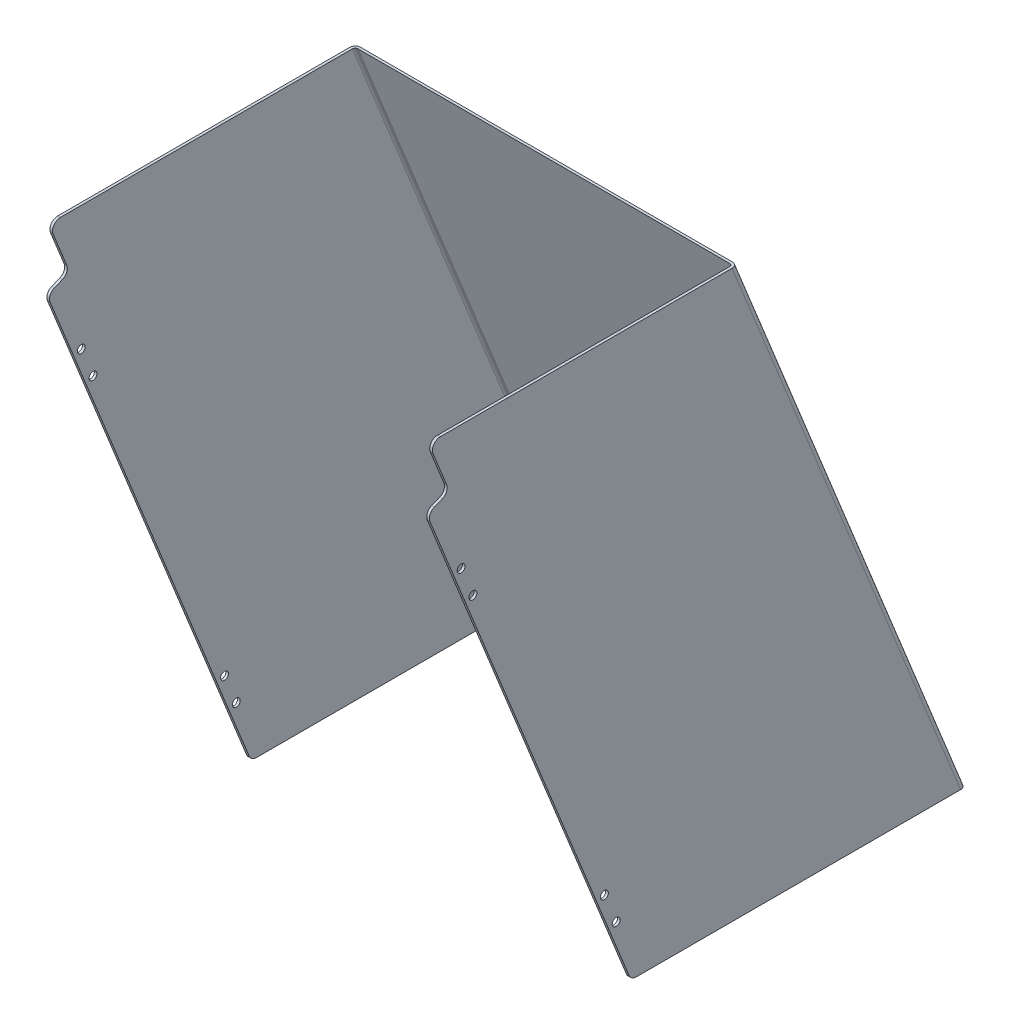
ISO-10303-21;
HEADER;
FILE_DESCRIPTION(('STEP AP214'),'2;1');
FILE_NAME('part.step','',(''),(''),'','','');
FILE_SCHEMA(('AUTOMOTIVE_DESIGN { 1 0 10303 214 1 1 1 1 }'));
ENDSEC;
DATA;
#1=APPLICATION_CONTEXT('core data for automotive mechanical design processes');
#2=APPLICATION_PROTOCOL_DEFINITION('international standard','automotive_design',2000,#1);
#3=PRODUCT_CONTEXT('',#1,'mechanical');
#4=PRODUCT('Part','Part','',(#3));
#5=PRODUCT_RELATED_PRODUCT_CATEGORY('part','',(#4));
#6=PRODUCT_DEFINITION_FORMATION('','',#4);
#7=PRODUCT_DEFINITION_CONTEXT('part definition',#1,'design');
#8=PRODUCT_DEFINITION('design','',#6,#7);
#9=PRODUCT_DEFINITION_SHAPE('','',#8);
#10=(LENGTH_UNIT() NAMED_UNIT(*) SI_UNIT(.MILLI.,.METRE.));
#11=(NAMED_UNIT(*) PLANE_ANGLE_UNIT() SI_UNIT($,.RADIAN.));
#12=(NAMED_UNIT(*) SI_UNIT($,.STERADIAN.) SOLID_ANGLE_UNIT());
#13=UNCERTAINTY_MEASURE_WITH_UNIT(LENGTH_MEASURE(1.E-05),#10,'distance_accuracy_value','');
#14=(GEOMETRIC_REPRESENTATION_CONTEXT(3) GLOBAL_UNCERTAINTY_ASSIGNED_CONTEXT((#13)) GLOBAL_UNIT_ASSIGNED_CONTEXT((#10,
#11,#12)) REPRESENTATION_CONTEXT('',''));
#15=CARTESIAN_POINT('',(0.,0.,0.));
#16=DIRECTION('',(0.,0.,1.));
#17=DIRECTION('',(1.,0.,0.));
#18=AXIS2_PLACEMENT_3D('',#15,#16,#17);
#19=CARTESIAN_POINT('',(231.775,-62.8672060767664,-57.15));
#20=DIRECTION('',(0.,0.374606593415897,-0.927183854566793));
#21=DIRECTION('',(0.,0.927183854566793,0.374606593415897));
#22=AXIS2_PLACEMENT_3D('',#19,#20,#21);
#23=PLANE('',#22);
#24=DIRECTION('',(-1.,0.,0.));
#25=VECTOR('',#24,1.);
#26=CARTESIAN_POINT('',(836.05878,-54.0357798620357,-53.5818721977024));
#27=LINE('',#26,#25);
#28=CARTESIAN_POINT('',(-231.775,-54.0357798620329,-53.5818721977072));
#29=VERTEX_POINT('',#28);
#30=CARTESIAN_POINT('',(-228.6,-54.0357798620329,-53.5818721977072));
#31=VERTEX_POINT('',#30);
#32=EDGE_CURVE('E218',#29,#31,#27,.F.);
#33=ORIENTED_EDGE('',*,*,#32,.T.);
#34=DIRECTION('',(0.,-0.927183854566865,-0.37460659341572));
#35=VECTOR('',#34,1.);
#36=CARTESIAN_POINT('',(-228.6,-13.0931278022874,-37.039967010342));
#37=LINE('',#36,#35);
#38=CARTESIAN_POINT('',(-228.6,-13.0931278022861,-37.0399670103347));
#39=VERTEX_POINT('',#38);
#40=EDGE_CURVE('E323',#39,#31,#37,.T.);
#41=ORIENTED_EDGE('',*,*,#40,.F.);
#42=DIRECTION('',(1.,0.,0.));
#43=VECTOR('',#42,1.);
#44=CARTESIAN_POINT('',(-836.05878,-13.0931278022921,-37.0399670103304));
#45=LINE('',#44,#43);
#46=CARTESIAN_POINT('',(-231.775,-13.0931278022861,-37.0399670103347));
#47=VERTEX_POINT('',#46);
#48=EDGE_CURVE('E172',#47,#39,#45,.T.);
#49=ORIENTED_EDGE('',*,*,#48,.F.);
#50=DIRECTION('',(0.,-0.927183854566865,-0.37460659341572));
#51=VECTOR('',#50,1.);
#52=CARTESIAN_POINT('',(-231.775,-13.0931278022874,-37.039967010342));
#53=LINE('',#52,#51);
#54=EDGE_CURVE('E296',#47,#29,#53,.T.);
#55=ORIENTED_EDGE('',*,*,#54,.T.);
#56=EDGE_LOOP('',(#33,#41,#49,#55));
#57=FACE_BOUND('',#56,.T.);
#58=ADVANCED_FACE('F16',(#57),#23,.F.);
#59=CARTESIAN_POINT('',(836.05878,-57.603907664319,-44.7504459829524));
#60=DIRECTION('',(-1.,0.,0.));
#61=DIRECTION('',(0.,0.,1.));
#62=AXIS2_PLACEMENT_3D('',#59,#60,#61);
#63=CYLINDRICAL_SURFACE('',#62,9.525);
#64=DIRECTION('',(1.,0.,0.));
#65=VECTOR('',#64,1.);
#66=CARTESIAN_POINT('',(231.775,-66.4353338790571,-48.3185737852411));
#67=LINE('',#66,#65);
#68=CARTESIAN_POINT('',(-231.775,-66.4353338790554,-48.3185737852406));
#69=VERTEX_POINT('',#68);
#70=CARTESIAN_POINT('',(-228.6,-66.4353338790554,-48.3185737852406));
#71=VERTEX_POINT('',#70);
#72=EDGE_CURVE('E215',#69,#71,#67,.T.);
#73=ORIENTED_EDGE('',*,*,#72,.T.);
#74=CARTESIAN_POINT('',(-228.6,-57.603907664319,-44.7504459829524));
#75=DIRECTION('',(-1.,0.,0.));
#76=DIRECTION('',(0.,0.,1.));
#77=AXIS2_PLACEMENT_3D('',#74,#75,#76);
#78=CIRCLE('',#77,9.525);
#79=EDGE_CURVE('E321',#31,#71,#78,.T.);
#80=ORIENTED_EDGE('',*,*,#79,.F.);
#81=ORIENTED_EDGE('',*,*,#32,.F.);
#82=CARTESIAN_POINT('',(-231.775,-57.603907664319,-44.7504459829524));
#83=DIRECTION('',(-1.,0.,0.));
#84=DIRECTION('',(0.,0.,1.));
#85=AXIS2_PLACEMENT_3D('',#82,#83,#84);
#86=CIRCLE('',#85,9.525);
#87=EDGE_CURVE('E293',#29,#69,#86,.T.);
#88=ORIENTED_EDGE('',*,*,#87,.T.);
#89=EDGE_LOOP('',(#73,#80,#81,#88));
#90=FACE_BOUND('',#89,.T.);
#91=ADVANCED_FACE('F456',(#90),#63,.F.);
#92=CARTESIAN_POINT('',(231.775,-73.8949077078062,-29.8554806696152));
#93=DIRECTION('',(0.,-0.927183854566793,-0.374606593415897));
#94=DIRECTION('',(0.,0.374606593415897,-0.927183854566793));
#95=AXIS2_PLACEMENT_3D('',#92,#93,#94);
#96=PLANE('',#95);
#97=ORIENTED_EDGE('',*,*,#72,.F.);
#98=DIRECTION('',(0.,-0.37460659341652,0.927183854566542));
#99=VECTOR('',#98,1.);
#100=CARTESIAN_POINT('',(-231.775,-66.4353338790538,-48.3185737852398));
#101=LINE('',#100,#99);
#102=CARTESIAN_POINT('',(-231.775,-70.3267799055257,-38.6869068843729));
#103=VERTEX_POINT('',#102);
#104=EDGE_CURVE('E292',#69,#103,#101,.T.);
#105=ORIENTED_EDGE('',*,*,#104,.T.);
#106=DIRECTION('',(-1.,0.,0.));
#107=VECTOR('',#106,1.);
#108=CARTESIAN_POINT('',(836.05878,-70.326779905529,-38.6869068843795));
#109=LINE('',#108,#107);
#110=CARTESIAN_POINT('',(-228.6,-70.3267799055257,-38.6869068843729));
#111=VERTEX_POINT('',#110);
#112=EDGE_CURVE('E213',#111,#103,#109,.T.);
#113=ORIENTED_EDGE('',*,*,#112,.F.);
#114=DIRECTION('',(0.,-0.37460659341652,0.927183854566542));
#115=VECTOR('',#114,1.);
#116=CARTESIAN_POINT('',(-228.6,-66.4353338790538,-48.3185737852398));
#117=LINE('',#116,#115);
#118=EDGE_CURVE('E320',#71,#111,#117,.T.);
#119=ORIENTED_EDGE('',*,*,#118,.F.);
#120=EDGE_LOOP('',(#97,#105,#113,#119));
#121=FACE_BOUND('',#120,.T.);
#122=ADVANCED_FACE('F462',(#121),#96,.F.);
#123=CARTESIAN_POINT('',(836.05878,-79.158206120279,-42.2550346866628));
#124=DIRECTION('',(-1.,0.,0.));
#125=DIRECTION('',(0.,0.,1.));
#126=AXIS2_PLACEMENT_3D('',#123,#124,#125);
#127=CYLINDRICAL_SURFACE('',#126,9.525);
#128=ORIENTED_EDGE('',*,*,#112,.T.);
#129=CARTESIAN_POINT('',(-231.775,-79.158206120279,-42.2550346866628));
#130=DIRECTION('',(-1.,0.,0.));
#131=DIRECTION('',(0.,0.,1.));
#132=AXIS2_PLACEMENT_3D('',#129,#130,#131);
#133=CIRCLE('',#132,9.525);
#134=CARTESIAN_POINT('',(-231.775,-82.7263339225661,-33.4236084719071));
#135=VERTEX_POINT('',#134);
#136=EDGE_CURVE('E289',#103,#135,#133,.F.);
#137=ORIENTED_EDGE('',*,*,#136,.T.);
#138=DIRECTION('',(1.,0.,0.));
#139=VECTOR('',#138,1.);
#140=CARTESIAN_POINT('',(-231.775,-82.7263339225632,-33.4236084719106));
#141=LINE('',#140,#139);
#142=CARTESIAN_POINT('',(-228.6,-82.7263339225661,-33.4236084719071));
#143=VERTEX_POINT('',#142);
#144=EDGE_CURVE('E210',#143,#135,#141,.F.);
#145=ORIENTED_EDGE('',*,*,#144,.F.);
#146=CARTESIAN_POINT('',(-228.6,-79.158206120279,-42.2550346866628));
#147=DIRECTION('',(-1.,0.,0.));
#148=DIRECTION('',(0.,0.,1.));
#149=AXIS2_PLACEMENT_3D('',#146,#147,#148);
#150=CIRCLE('',#149,9.525);
#151=EDGE_CURVE('E318',#111,#143,#150,.F.);
#152=ORIENTED_EDGE('',*,*,#151,.F.);
#153=EDGE_LOOP('',(#128,#137,#145,#152));
#154=FACE_BOUND('',#153,.T.);
#155=ADVANCED_FACE('F465',(#154),#127,.T.);
#156=CARTESIAN_POINT('',(-231.775,0.,0.));
#157=DIRECTION('',(0.,-0.374606593415897,0.927183854566793));
#158=DIRECTION('',(0.,-0.927183854566793,-0.374606593415897));
#159=AXIS2_PLACEMENT_3D('',#156,#157,#158);
#160=PLANE('',#159);
#161=DIRECTION('',(0.,-0.927183854566812,-0.374606593415852));
#162=VECTOR('',#161,1.);
#163=CARTESIAN_POINT('',(-231.775,-82.7263339225664,-33.4236084719026));
#164=LINE('',#163,#162);
#165=CARTESIAN_POINT('',(-231.775,-679.843127802274,-274.674453085955));
#166=VERTEX_POINT('',#165);
#167=EDGE_CURVE('E288',#135,#166,#164,.T.);
#168=ORIENTED_EDGE('',*,*,#167,.T.);
#169=DIRECTION('',(-1.,0.,0.));
#170=VECTOR('',#169,1.);
#171=CARTESIAN_POINT('',(836.05878,-679.8431278022,-274.674453086014));
#172=LINE('',#171,#170);
#173=CARTESIAN_POINT('',(-228.6,-679.843127802274,-274.674453085955));
#174=VERTEX_POINT('',#173);
#175=EDGE_CURVE('E222',#174,#166,#172,.T.);
#176=ORIENTED_EDGE('',*,*,#175,.F.);
#177=DIRECTION('',(0.,-0.927183854566812,-0.374606593415852));
#178=VECTOR('',#177,1.);
#179=CARTESIAN_POINT('',(-228.6,-82.7263339225664,-33.4236084719026));
#180=LINE('',#179,#178);
#181=EDGE_CURVE('E317',#143,#174,#180,.T.);
#182=ORIENTED_EDGE('',*,*,#181,.F.);
#183=ORIENTED_EDGE('',*,*,#144,.T.);
#184=EDGE_LOOP('',(#168,#176,#182,#183));
#185=FACE_BOUND('',#184,.T.);
#186=ADVANCED_FACE('F470',(#185),#160,.T.);
#187=CARTESIAN_POINT('',(-231.775,-615.95,-259.132997227254));
#188=DIRECTION('',(-1.,0.,0.));
#189=DIRECTION('',(0.,0.,1.));
#190=AXIS2_PLACEMENT_3D('',#187,#188,#189);
#191=CYLINDRICAL_SURFACE('',#190,4.7625);
#192=CARTESIAN_POINT('',(-231.775,-615.95,-259.132997227254));
#193=DIRECTION('',(-1.,0.,0.));
#194=DIRECTION('',(0.,0.,1.));
#195=AXIS2_PLACEMENT_3D('',#192,#193,#194);
#196=CIRCLE('',#195,4.7625);
#197=CARTESIAN_POINT('',(-231.775,-615.95,-254.370497227254));
#198=VERTEX_POINT('',#197);
#199=EDGE_CURVE('E285',#198,#198,#196,.T.);
#200=ORIENTED_EDGE('',*,*,#199,.T.);
#201=EDGE_LOOP('',(#200));
#202=FACE_BOUND('',#201,.T.);
#203=CARTESIAN_POINT('',(-228.6,-615.95,-259.132997227254));
#204=DIRECTION('',(-1.,0.,0.));
#205=DIRECTION('',(0.,0.,1.));
#206=AXIS2_PLACEMENT_3D('',#203,#204,#205);
#207=CIRCLE('',#206,4.7625);
#208=CARTESIAN_POINT('',(-228.6,-615.95,-254.370497227254));
#209=VERTEX_POINT('',#208);
#210=EDGE_CURVE('E314',#209,#209,#207,.T.);
#211=ORIENTED_EDGE('',*,*,#210,.F.);
#212=EDGE_LOOP('',(#211));
#213=FACE_BOUND('',#212,.T.);
#214=ADVANCED_FACE('F734',(#202,#213),#191,.F.);
#215=CARTESIAN_POINT('',(-231.775,-580.62429514101,-244.860486018028));
#216=DIRECTION('',(-1.,0.,0.));
#217=DIRECTION('',(0.,0.,1.));
#218=AXIS2_PLACEMENT_3D('',#215,#216,#217);
#219=CYLINDRICAL_SURFACE('',#218,4.7625);
#220=CARTESIAN_POINT('',(-231.775,-580.62429514101,-244.860486018028));
#221=DIRECTION('',(-1.,0.,0.));
#222=DIRECTION('',(0.,0.,1.));
#223=AXIS2_PLACEMENT_3D('',#220,#221,#222);
#224=CIRCLE('',#223,4.7625);
#225=CARTESIAN_POINT('',(-231.775,-580.62429514101,-240.097986018028));
#226=VERTEX_POINT('',#225);
#227=EDGE_CURVE('E282',#226,#226,#224,.T.);
#228=ORIENTED_EDGE('',*,*,#227,.T.);
#229=EDGE_LOOP('',(#228));
#230=FACE_BOUND('',#229,.T.);
#231=CARTESIAN_POINT('',(-228.6,-580.62429514101,-244.860486018028));
#232=DIRECTION('',(-1.,0.,0.));
#233=DIRECTION('',(0.,0.,1.));
#234=AXIS2_PLACEMENT_3D('',#231,#232,#233);
#235=CIRCLE('',#234,4.7625);
#236=CARTESIAN_POINT('',(-228.6,-580.62429514101,-240.097986018028));
#237=VERTEX_POINT('',#236);
#238=EDGE_CURVE('E311',#237,#237,#235,.T.);
#239=ORIENTED_EDGE('',*,*,#238,.F.);
#240=EDGE_LOOP('',(#239));
#241=FACE_BOUND('',#240,.T.);
#242=ADVANCED_FACE('F724',(#230,#241),#219,.F.);
#243=CARTESIAN_POINT('',(-231.775,-186.153924215562,-85.4841108492164));
#244=DIRECTION('',(-1.,0.,0.));
#245=DIRECTION('',(0.,0.,1.));
#246=AXIS2_PLACEMENT_3D('',#243,#244,#245);
#247=CYLINDRICAL_SURFACE('',#246,4.7625);
#248=CARTESIAN_POINT('',(-231.775,-186.153924215562,-85.4841108492164));
#249=DIRECTION('',(-1.,0.,0.));
#250=DIRECTION('',(0.,0.,1.));
#251=AXIS2_PLACEMENT_3D('',#248,#249,#250);
#252=CIRCLE('',#251,4.7625);
#253=CARTESIAN_POINT('',(-231.775,-186.153924215562,-80.7216108492164));
#254=VERTEX_POINT('',#253);
#255=EDGE_CURVE('E279',#254,#254,#252,.T.);
#256=ORIENTED_EDGE('',*,*,#255,.T.);
#257=EDGE_LOOP('',(#256));
#258=FACE_BOUND('',#257,.T.);
#259=CARTESIAN_POINT('',(-228.6,-186.153924215562,-85.4841108492164));
#260=DIRECTION('',(-1.,0.,0.));
#261=DIRECTION('',(0.,0.,1.));
#262=AXIS2_PLACEMENT_3D('',#259,#260,#261);
#263=CIRCLE('',#262,4.7625);
#264=CARTESIAN_POINT('',(-228.6,-186.153924215562,-80.7216108492164));
#265=VERTEX_POINT('',#264);
#266=EDGE_CURVE('E308',#265,#265,#263,.T.);
#267=ORIENTED_EDGE('',*,*,#266,.F.);
#268=EDGE_LOOP('',(#267));
#269=FACE_BOUND('',#268,.T.);
#270=ADVANCED_FACE('F714',(#258,#269),#247,.F.);
#271=CARTESIAN_POINT('',(-231.775,-150.828219356572,-71.2115996400668));
#272=DIRECTION('',(-1.,0.,0.));
#273=DIRECTION('',(0.,0.,1.));
#274=AXIS2_PLACEMENT_3D('',#271,#272,#273);
#275=CYLINDRICAL_SURFACE('',#274,4.7625);
#276=CARTESIAN_POINT('',(-231.775,-150.828219356572,-71.2115996400668));
#277=DIRECTION('',(-1.,0.,0.));
#278=DIRECTION('',(0.,0.,1.));
#279=AXIS2_PLACEMENT_3D('',#276,#277,#278);
#280=CIRCLE('',#279,4.7625);
#281=CARTESIAN_POINT('',(-231.775,-150.828219356572,-66.4490996400668));
#282=VERTEX_POINT('',#281);
#283=EDGE_CURVE('E275',#282,#282,#280,.T.);
#284=ORIENTED_EDGE('',*,*,#283,.T.);
#285=EDGE_LOOP('',(#284));
#286=FACE_BOUND('',#285,.T.);
#287=CARTESIAN_POINT('',(-228.6,-150.828219356572,-71.2115996400668));
#288=DIRECTION('',(-1.,0.,0.));
#289=DIRECTION('',(0.,0.,1.));
#290=AXIS2_PLACEMENT_3D('',#287,#288,#289);
#291=CIRCLE('',#290,4.7625);
#292=CARTESIAN_POINT('',(-228.6,-150.828219356572,-66.4490996400668));
#293=VERTEX_POINT('',#292);
#294=EDGE_CURVE('E305',#293,#293,#291,.T.);
#295=ORIENTED_EDGE('',*,*,#294,.F.);
#296=EDGE_LOOP('',(#295));
#297=FACE_BOUND('',#296,.T.);
#298=ADVANCED_FACE('F705',(#286,#297),#275,.F.);
#299=CARTESIAN_POINT('',(-225.425,894.00888,-38.348270734471));
#300=DIRECTION('',(0.,-0.927183854566793,-0.374606593415897));
#301=DIRECTION('',(0.,0.374606593415897,-0.927183854566793));
#302=AXIS2_PLACEMENT_3D('',#299,#300,#301);
#303=CYLINDRICAL_SURFACE('',#302,6.35);
#304=DIRECTION('',(0.,0.927183854566793,0.374606593415897));
#305=VECTOR('',#304,1.);
#306=CARTESIAN_POINT('',(-225.425,-685.8,-683.48118567777));
#307=LINE('',#306,#305);
#308=CARTESIAN_POINT('',(-225.425,-685.8,-683.48118567774));
#309=VERTEX_POINT('',#308);
#310=CARTESIAN_POINT('',(-225.425,0.,-406.400000000002));
#311=VERTEX_POINT('',#310);
#312=EDGE_CURVE('E278',#309,#311,#307,.T.);
#313=ORIENTED_EDGE('',*,*,#312,.F.);
#314=CARTESIAN_POINT('',(-225.425,-685.8,-676.632490061708));
#315=DIRECTION('',(0.,-1.,0.));
#316=DIRECTION('',(0.,0.,-1.));
#317=AXIS2_PLACEMENT_3D('',#314,#315,#316);
#318=ELLIPSE('',#317,6.84869561600261,6.35);
#319=CARTESIAN_POINT('',(-231.775,-685.8,-676.63249006173));
#320=VERTEX_POINT('',#319);
#321=EDGE_CURVE('E231',#320,#309,#318,.T.);
#322=ORIENTED_EDGE('',*,*,#321,.F.);
#323=DIRECTION('',(0.,0.927183854566778,0.374606593415935));
#324=VECTOR('',#323,1.);
#325=CARTESIAN_POINT('',(-231.775,-685.8,-676.632490061752));
#326=LINE('',#325,#324);
#327=CARTESIAN_POINT('',(-231.775,0.,-399.551304383976));
#328=VERTEX_POINT('',#327);
#329=EDGE_CURVE('E300',#320,#328,#326,.T.);
#330=ORIENTED_EDGE('',*,*,#329,.T.);
#331=CARTESIAN_POINT('',(-225.425,0.,-399.55130438397));
#332=DIRECTION('',(0.,1.,0.));
#333=DIRECTION('',(0.,0.,-1.));
#334=AXIS2_PLACEMENT_3D('',#331,#332,#333);
#335=ELLIPSE('',#334,6.84869561600261,6.35);
#336=EDGE_CURVE('E243',#311,#328,#335,.T.);
#337=ORIENTED_EDGE('',*,*,#336,.F.);
#338=EDGE_LOOP('',(#313,#322,#330,#337));
#339=FACE_BOUND('',#338,.T.);
#340=ADVANCED_FACE('F437',(#339),#303,.T.);
#341=CARTESIAN_POINT('',(225.425,-1579.80888,-1037.83552371139));
#342=DIRECTION('',(0.,0.927183854566793,0.374606593415897));
#343=DIRECTION('',(0.,-0.374606593415897,0.927183854566793));
#344=AXIS2_PLACEMENT_3D('',#341,#342,#343);
#345=CYLINDRICAL_SURFACE('',#344,6.35);
#346=DIRECTION('',(0.,0.927183854566793,0.374606593415897));
#347=VECTOR('',#346,1.);
#348=CARTESIAN_POINT('',(225.425,-685.8,-683.48118567777));
#349=LINE('',#348,#347);
#350=CARTESIAN_POINT('',(225.425,2.77555756156289E-12,-406.400000000085));
#351=VERTEX_POINT('',#350);
#352=CARTESIAN_POINT('',(225.425,-685.8,-683.481185677832));
#353=VERTEX_POINT('',#352);
#354=EDGE_CURVE('E366',#351,#353,#349,.F.);
#355=ORIENTED_EDGE('',*,*,#354,.F.);
#356=CARTESIAN_POINT('',(225.425,0.,-399.551304384153));
#357=DIRECTION('',(0.,1.,0.));
#358=DIRECTION('',(0.,0.,1.));
#359=AXIS2_PLACEMENT_3D('',#356,#357,#358);
#360=ELLIPSE('',#359,6.84869561600261,6.35);
#361=CARTESIAN_POINT('',(231.775,0.,-399.551304384067));
#362=VERTEX_POINT('',#361);
#363=EDGE_CURVE('E189',#362,#351,#360,.T.);
#364=ORIENTED_EDGE('',*,*,#363,.F.);
#365=DIRECTION('',(0.,0.927183854566778,0.374606593415935));
#366=VECTOR('',#365,1.);
#367=CARTESIAN_POINT('',(231.775,-685.8,-676.632490061752));
#368=LINE('',#367,#366);
#369=CARTESIAN_POINT('',(231.775,-685.8,-676.632490061821));
#370=VERTEX_POINT('',#369);
#371=EDGE_CURVE('E274',#370,#362,#368,.T.);
#372=ORIENTED_EDGE('',*,*,#371,.F.);
#373=CARTESIAN_POINT('',(225.425,-685.8,-676.632490061891));
#374=DIRECTION('',(0.,-1.,0.));
#375=DIRECTION('',(0.,0.,1.));
#376=AXIS2_PLACEMENT_3D('',#373,#374,#375);
#377=ELLIPSE('',#376,6.84869561600261,6.35);
#378=EDGE_CURVE('E226',#353,#370,#377,.T.);
#379=ORIENTED_EDGE('',*,*,#378,.F.);
#380=EDGE_LOOP('',(#355,#364,#372,#379));
#381=FACE_BOUND('',#380,.T.);
#382=ADVANCED_FACE('F434',(#381),#345,.T.);
#383=CARTESIAN_POINT('',(231.775,-62.8672060767664,-57.15));
#384=DIRECTION('',(0.,0.374606593415897,-0.927183854566793));
#385=DIRECTION('',(0.,0.927183854566793,0.374606593415897));
#386=AXIS2_PLACEMENT_3D('',#383,#384,#385);
#387=PLANE('',#386);
#388=DIRECTION('',(-1.,0.,0.));
#389=VECTOR('',#388,1.);
#390=CARTESIAN_POINT('',(836.05878,-54.0357798620357,-53.5818721977024));
#391=LINE('',#390,#389);
#392=CARTESIAN_POINT('',(228.6,-54.0357798620329,-53.5818721977072));
#393=VERTEX_POINT('',#392);
#394=CARTESIAN_POINT('',(231.775,-54.0357798620329,-53.5818721977072));
#395=VERTEX_POINT('',#394);
#396=EDGE_CURVE('E207',#393,#395,#391,.F.);
#397=ORIENTED_EDGE('',*,*,#396,.T.);
#398=DIRECTION('',(0.,-0.927183854566865,-0.37460659341572));
#399=VECTOR('',#398,1.);
#400=CARTESIAN_POINT('',(231.775,-13.0931278022874,-37.039967010342));
#401=LINE('',#400,#399);
#402=CARTESIAN_POINT('',(231.775,-13.0931278022861,-37.0399670103347));
#403=VERTEX_POINT('',#402);
#404=EDGE_CURVE('E272',#403,#395,#401,.T.);
#405=ORIENTED_EDGE('',*,*,#404,.F.);
#406=DIRECTION('',(1.,0.,0.));
#407=VECTOR('',#406,1.);
#408=CARTESIAN_POINT('',(-836.05878,-13.0931278022921,-37.0399670103304));
#409=LINE('',#408,#407);
#410=CARTESIAN_POINT('',(228.6,-13.0931278022861,-37.0399670103347));
#411=VERTEX_POINT('',#410);
#412=EDGE_CURVE('E201',#411,#403,#409,.T.);
#413=ORIENTED_EDGE('',*,*,#412,.F.);
#414=DIRECTION('',(0.,-0.927183854566865,-0.37460659341572));
#415=VECTOR('',#414,1.);
#416=CARTESIAN_POINT('',(228.6,-13.0931278022874,-37.039967010342));
#417=LINE('',#416,#415);
#418=EDGE_CURVE('E169',#411,#393,#417,.T.);
#419=ORIENTED_EDGE('',*,*,#418,.T.);
#420=EDGE_LOOP('',(#397,#405,#413,#419));
#421=FACE_BOUND('',#420,.T.);
#422=ADVANCED_FACE('F680',(#421),#387,.F.);
#423=CARTESIAN_POINT('',(836.05878,-57.603907664319,-44.7504459829524));
#424=DIRECTION('',(-1.,0.,0.));
#425=DIRECTION('',(0.,0.,1.));
#426=AXIS2_PLACEMENT_3D('',#423,#424,#425);
#427=CYLINDRICAL_SURFACE('',#426,9.525);
#428=DIRECTION('',(1.,0.,0.));
#429=VECTOR('',#428,1.);
#430=CARTESIAN_POINT('',(231.775,-66.4353338790571,-48.3185737852411));
#431=LINE('',#430,#429);
#432=CARTESIAN_POINT('',(228.6,-66.4353338790554,-48.3185737852406));
#433=VERTEX_POINT('',#432);
#434=CARTESIAN_POINT('',(231.775,-66.4353338790554,-48.3185737852406));
#435=VERTEX_POINT('',#434);
#436=EDGE_CURVE('E204',#433,#435,#431,.T.);
#437=ORIENTED_EDGE('',*,*,#436,.T.);
#438=CARTESIAN_POINT('',(231.775,-57.603907664319,-44.7504459829524));
#439=DIRECTION('',(-1.,0.,0.));
#440=DIRECTION('',(0.,0.,1.));
#441=AXIS2_PLACEMENT_3D('',#438,#439,#440);
#442=CIRCLE('',#441,9.525);
#443=EDGE_CURVE('E270',#395,#435,#442,.T.);
#444=ORIENTED_EDGE('',*,*,#443,.F.);
#445=ORIENTED_EDGE('',*,*,#396,.F.);
#446=CARTESIAN_POINT('',(228.6,-57.603907664319,-44.7504459829524));
#447=DIRECTION('',(-1.,0.,0.));
#448=DIRECTION('',(0.,0.,1.));
#449=AXIS2_PLACEMENT_3D('',#446,#447,#448);
#450=CIRCLE('',#449,9.525);
#451=EDGE_CURVE('E343',#393,#433,#450,.T.);
#452=ORIENTED_EDGE('',*,*,#451,.T.);
#453=EDGE_LOOP('',(#437,#444,#445,#452));
#454=FACE_BOUND('',#453,.T.);
#455=ADVANCED_FACE('F670',(#454),#427,.F.);
#456=CARTESIAN_POINT('',(231.775,-73.8949077078062,-29.8554806696152));
#457=DIRECTION('',(0.,-0.927183854566793,-0.374606593415897));
#458=DIRECTION('',(0.,0.374606593415897,-0.927183854566793));
#459=AXIS2_PLACEMENT_3D('',#456,#457,#458);
#460=PLANE('',#459);
#461=ORIENTED_EDGE('',*,*,#436,.F.);
#462=DIRECTION('',(0.,-0.37460659341652,0.927183854566542));
#463=VECTOR('',#462,1.);
#464=CARTESIAN_POINT('',(228.6,-66.4353338790538,-48.3185737852398));
#465=LINE('',#464,#463);
#466=CARTESIAN_POINT('',(228.6,-70.3267799055257,-38.6869068843729));
#467=VERTEX_POINT('',#466);
#468=EDGE_CURVE('E342',#433,#467,#465,.T.);
#469=ORIENTED_EDGE('',*,*,#468,.T.);
#470=DIRECTION('',(-1.,0.,0.));
#471=VECTOR('',#470,1.);
#472=CARTESIAN_POINT('',(836.05878,-70.326779905529,-38.6869068843795));
#473=LINE('',#472,#471);
#474=CARTESIAN_POINT('',(231.775,-70.3267799055257,-38.6869068843729));
#475=VERTEX_POINT('',#474);
#476=EDGE_CURVE('E202',#475,#467,#473,.T.);
#477=ORIENTED_EDGE('',*,*,#476,.F.);
#478=DIRECTION('',(0.,-0.37460659341652,0.927183854566542));
#479=VECTOR('',#478,1.);
#480=CARTESIAN_POINT('',(231.775,-66.4353338790538,-48.3185737852398));
#481=LINE('',#480,#479);
#482=EDGE_CURVE('E269',#435,#475,#481,.T.);
#483=ORIENTED_EDGE('',*,*,#482,.F.);
#484=EDGE_LOOP('',(#461,#469,#477,#483));
#485=FACE_BOUND('',#484,.T.);
#486=ADVANCED_FACE('F660',(#485),#460,.F.);
#487=CARTESIAN_POINT('',(836.05878,-79.158206120279,-42.2550346866628));
#488=DIRECTION('',(-1.,0.,0.));
#489=DIRECTION('',(0.,0.,1.));
#490=AXIS2_PLACEMENT_3D('',#487,#488,#489);
#491=CYLINDRICAL_SURFACE('',#490,9.525);
#492=ORIENTED_EDGE('',*,*,#476,.T.);
#493=CARTESIAN_POINT('',(228.6,-79.158206120279,-42.2550346866628));
#494=DIRECTION('',(-1.,0.,0.));
#495=DIRECTION('',(0.,0.,1.));
#496=AXIS2_PLACEMENT_3D('',#493,#494,#495);
#497=CIRCLE('',#496,9.525);
#498=CARTESIAN_POINT('',(228.6,-82.7263339225661,-33.4236084719071));
#499=VERTEX_POINT('',#498);
#500=EDGE_CURVE('E340',#467,#499,#497,.F.);
#501=ORIENTED_EDGE('',*,*,#500,.T.);
#502=DIRECTION('',(1.,0.,0.));
#503=VECTOR('',#502,1.);
#504=CARTESIAN_POINT('',(-231.775,-82.7263339225632,-33.4236084719106));
#505=LINE('',#504,#503);
#506=CARTESIAN_POINT('',(231.775,-82.7263339225661,-33.4236084719071));
#507=VERTEX_POINT('',#506);
#508=EDGE_CURVE('E199',#507,#499,#505,.F.);
#509=ORIENTED_EDGE('',*,*,#508,.F.);
#510=CARTESIAN_POINT('',(231.775,-79.158206120279,-42.2550346866628));
#511=DIRECTION('',(-1.,0.,0.));
#512=DIRECTION('',(0.,0.,1.));
#513=AXIS2_PLACEMENT_3D('',#510,#511,#512);
#514=CIRCLE('',#513,9.525);
#515=EDGE_CURVE('E267',#475,#507,#514,.F.);
#516=ORIENTED_EDGE('',*,*,#515,.F.);
#517=EDGE_LOOP('',(#492,#501,#509,#516));
#518=FACE_BOUND('',#517,.T.);
#519=ADVANCED_FACE('F650',(#518),#491,.T.);
#520=CARTESIAN_POINT('',(231.775,-615.95,-259.132997227254));
#521=DIRECTION('',(-1.,0.,0.));
#522=DIRECTION('',(0.,0.,1.));
#523=AXIS2_PLACEMENT_3D('',#520,#521,#522);
#524=CYLINDRICAL_SURFACE('',#523,4.7625);
#525=CARTESIAN_POINT('',(228.6,-615.95,-259.132997227254));
#526=DIRECTION('',(-1.,0.,0.));
#527=DIRECTION('',(0.,0.,1.));
#528=AXIS2_PLACEMENT_3D('',#525,#526,#527);
#529=CIRCLE('',#528,4.7625);
#530=CARTESIAN_POINT('',(228.6,-615.95,-254.370497227254));
#531=VERTEX_POINT('',#530);
#532=EDGE_CURVE('E336',#531,#531,#529,.T.);
#533=ORIENTED_EDGE('',*,*,#532,.T.);
#534=EDGE_LOOP('',(#533));
#535=FACE_BOUND('',#534,.T.);
#536=CARTESIAN_POINT('',(231.775,-615.95,-259.132997227254));
#537=DIRECTION('',(-1.,0.,0.));
#538=DIRECTION('',(0.,0.,1.));
#539=AXIS2_PLACEMENT_3D('',#536,#537,#538);
#540=CIRCLE('',#539,4.7625);
#541=CARTESIAN_POINT('',(231.775,-615.95,-254.370497227254));
#542=VERTEX_POINT('',#541);
#543=EDGE_CURVE('E263',#542,#542,#540,.T.);
#544=ORIENTED_EDGE('',*,*,#543,.F.);
#545=EDGE_LOOP('',(#544));
#546=FACE_BOUND('',#545,.T.);
#547=ADVANCED_FACE('F640',(#535,#546),#524,.F.);
#548=CARTESIAN_POINT('',(231.775,-580.62429514101,-244.860486018028));
#549=DIRECTION('',(-1.,0.,0.));
#550=DIRECTION('',(0.,0.,1.));
#551=AXIS2_PLACEMENT_3D('',#548,#549,#550);
#552=CYLINDRICAL_SURFACE('',#551,4.7625);
#553=CARTESIAN_POINT('',(228.6,-580.62429514101,-244.860486018028));
#554=DIRECTION('',(-1.,0.,0.));
#555=DIRECTION('',(0.,0.,1.));
#556=AXIS2_PLACEMENT_3D('',#553,#554,#555);
#557=CIRCLE('',#556,4.7625);
#558=CARTESIAN_POINT('',(228.6,-580.62429514101,-240.097986018028));
#559=VERTEX_POINT('',#558);
#560=EDGE_CURVE('E333',#559,#559,#557,.T.);
#561=ORIENTED_EDGE('',*,*,#560,.T.);
#562=EDGE_LOOP('',(#561));
#563=FACE_BOUND('',#562,.T.);
#564=CARTESIAN_POINT('',(231.775,-580.62429514101,-244.860486018028));
#565=DIRECTION('',(-1.,0.,0.));
#566=DIRECTION('',(0.,0.,1.));
#567=AXIS2_PLACEMENT_3D('',#564,#565,#566);
#568=CIRCLE('',#567,4.7625);
#569=CARTESIAN_POINT('',(231.775,-580.62429514101,-240.097986018028));
#570=VERTEX_POINT('',#569);
#571=EDGE_CURVE('E260',#570,#570,#568,.T.);
#572=ORIENTED_EDGE('',*,*,#571,.F.);
#573=EDGE_LOOP('',(#572));
#574=FACE_BOUND('',#573,.T.);
#575=ADVANCED_FACE('F630',(#563,#574),#552,.F.);
#576=CARTESIAN_POINT('',(231.775,-186.153924215562,-85.4841108492164));
#577=DIRECTION('',(-1.,0.,0.));
#578=DIRECTION('',(0.,0.,1.));
#579=AXIS2_PLACEMENT_3D('',#576,#577,#578);
#580=CYLINDRICAL_SURFACE('',#579,4.7625);
#581=CARTESIAN_POINT('',(228.6,-186.153924215562,-85.4841108492164));
#582=DIRECTION('',(-1.,0.,0.));
#583=DIRECTION('',(0.,0.,1.));
#584=AXIS2_PLACEMENT_3D('',#581,#582,#583);
#585=CIRCLE('',#584,4.7625);
#586=CARTESIAN_POINT('',(228.6,-186.153924215562,-80.7216108492164));
#587=VERTEX_POINT('',#586);
#588=EDGE_CURVE('E330',#587,#587,#585,.T.);
#589=ORIENTED_EDGE('',*,*,#588,.T.);
#590=EDGE_LOOP('',(#589));
#591=FACE_BOUND('',#590,.T.);
#592=CARTESIAN_POINT('',(231.775,-186.153924215562,-85.4841108492164));
#593=DIRECTION('',(-1.,0.,0.));
#594=DIRECTION('',(0.,0.,1.));
#595=AXIS2_PLACEMENT_3D('',#592,#593,#594);
#596=CIRCLE('',#595,4.7625);
#597=CARTESIAN_POINT('',(231.775,-186.153924215562,-80.7216108492164));
#598=VERTEX_POINT('',#597);
#599=EDGE_CURVE('E257',#598,#598,#596,.T.);
#600=ORIENTED_EDGE('',*,*,#599,.F.);
#601=EDGE_LOOP('',(#600));
#602=FACE_BOUND('',#601,.T.);
#603=ADVANCED_FACE('F620',(#591,#602),#580,.F.);
#604=CARTESIAN_POINT('',(231.775,-150.828219356572,-71.2115996400668));
#605=DIRECTION('',(-1.,0.,0.));
#606=DIRECTION('',(0.,0.,1.));
#607=AXIS2_PLACEMENT_3D('',#604,#605,#606);
#608=CYLINDRICAL_SURFACE('',#607,4.7625);
#609=CARTESIAN_POINT('',(228.6,-150.828219356572,-71.2115996400668));
#610=DIRECTION('',(-1.,0.,0.));
#611=DIRECTION('',(0.,0.,1.));
#612=AXIS2_PLACEMENT_3D('',#609,#610,#611);
#613=CIRCLE('',#612,4.7625);
#614=CARTESIAN_POINT('',(228.6,-150.828219356572,-66.4490996400668));
#615=VERTEX_POINT('',#614);
#616=EDGE_CURVE('E327',#615,#615,#613,.T.);
#617=ORIENTED_EDGE('',*,*,#616,.T.);
#618=EDGE_LOOP('',(#617));
#619=FACE_BOUND('',#618,.T.);
#620=CARTESIAN_POINT('',(231.775,-150.828219356572,-71.2115996400668));
#621=DIRECTION('',(-1.,0.,0.));
#622=DIRECTION('',(0.,0.,1.));
#623=AXIS2_PLACEMENT_3D('',#620,#621,#622);
#624=CIRCLE('',#623,4.7625);
#625=CARTESIAN_POINT('',(231.775,-150.828219356572,-66.4490996400668));
#626=VERTEX_POINT('',#625);
#627=EDGE_CURVE('E254',#626,#626,#624,.T.);
#628=ORIENTED_EDGE('',*,*,#627,.F.);
#629=EDGE_LOOP('',(#628));
#630=FACE_BOUND('',#629,.T.);
#631=ADVANCED_FACE('F610',(#619,#630),#608,.F.);
#632=CARTESIAN_POINT('',(-231.775,0.,0.));
#633=DIRECTION('',(0.,-0.374606593415897,0.927183854566793));
#634=DIRECTION('',(0.,-0.927183854566793,-0.374606593415897));
#635=AXIS2_PLACEMENT_3D('',#632,#633,#634);
#636=PLANE('',#635);
#637=DIRECTION('',(0.,-0.927183854566812,-0.374606593415852));
#638=VECTOR('',#637,1.);
#639=CARTESIAN_POINT('',(228.6,-82.7263339225664,-33.4236084719026));
#640=LINE('',#639,#638);
#641=CARTESIAN_POINT('',(228.6,-679.843127802274,-274.674453085955));
#642=VERTEX_POINT('',#641);
#643=EDGE_CURVE('E339',#499,#642,#640,.T.);
#644=ORIENTED_EDGE('',*,*,#643,.T.);
#645=DIRECTION('',(-1.,0.,0.));
#646=VECTOR('',#645,1.);
#647=CARTESIAN_POINT('',(836.05878,-679.8431278022,-274.674453086014));
#648=LINE('',#647,#646);
#649=CARTESIAN_POINT('',(231.775,-679.843127802274,-274.674453085955));
#650=VERTEX_POINT('',#649);
#651=EDGE_CURVE('E195',#650,#642,#648,.T.);
#652=ORIENTED_EDGE('',*,*,#651,.F.);
#653=DIRECTION('',(0.,-0.927183854566812,-0.374606593415852));
#654=VECTOR('',#653,1.);
#655=CARTESIAN_POINT('',(231.775,-82.7263339225664,-33.4236084719026));
#656=LINE('',#655,#654);
#657=EDGE_CURVE('E266',#507,#650,#656,.T.);
#658=ORIENTED_EDGE('',*,*,#657,.F.);
#659=ORIENTED_EDGE('',*,*,#508,.T.);
#660=EDGE_LOOP('',(#644,#652,#658,#659));
#661=FACE_BOUND('',#660,.T.);
#662=ADVANCED_FACE('F601',(#661),#636,.T.);
#663=CARTESIAN_POINT('',(-836.05878,-9.525,-45.8713932250768));
#664=DIRECTION('',(1.,0.,0.));
#665=DIRECTION('',(0.,0.,-1.));
#666=AXIS2_PLACEMENT_3D('',#663,#664,#665);
#667=CYLINDRICAL_SURFACE('',#666,9.525);
#668=ORIENTED_EDGE('',*,*,#412,.T.);
#669=CARTESIAN_POINT('',(231.775,-9.525,-45.8713932250768));
#670=DIRECTION('',(1.,0.,0.));
#671=DIRECTION('',(0.,0.,-1.));
#672=AXIS2_PLACEMENT_3D('',#669,#670,#671);
#673=CIRCLE('',#672,9.525);
#674=CARTESIAN_POINT('',(231.775,0.,-45.8713932250768));
#675=VERTEX_POINT('',#674);
#676=EDGE_CURVE('E185',#675,#403,#673,.T.);
#677=ORIENTED_EDGE('',*,*,#676,.F.);
#678=DIRECTION('',(1.,0.,0.));
#679=VECTOR('',#678,1.);
#680=CARTESIAN_POINT('',(-231.775,0.,-45.8713932250768));
#681=LINE('',#680,#679);
#682=CARTESIAN_POINT('',(228.6,0.,-45.8713932250768));
#683=VERTEX_POINT('',#682);
#684=EDGE_CURVE('E177',#683,#675,#681,.T.);
#685=ORIENTED_EDGE('',*,*,#684,.F.);
#686=CARTESIAN_POINT('',(228.6,-9.525,-45.8713932250768));
#687=DIRECTION('',(1.,0.,0.));
#688=DIRECTION('',(0.,0.,-1.));
#689=AXIS2_PLACEMENT_3D('',#686,#687,#688);
#690=CIRCLE('',#689,9.525);
#691=EDGE_CURVE('E19',#683,#411,#690,.T.);
#692=ORIENTED_EDGE('',*,*,#691,.T.);
#693=EDGE_LOOP('',(#668,#677,#685,#692));
#694=FACE_BOUND('',#693,.T.);
#695=ADVANCED_FACE('F183',(#694),#667,.T.);
#696=CARTESIAN_POINT('',(-836.05878,-9.525,-45.8713932250768));
#697=DIRECTION('',(1.,0.,0.));
#698=DIRECTION('',(0.,0.,-1.));
#699=AXIS2_PLACEMENT_3D('',#696,#697,#698);
#700=CYLINDRICAL_SURFACE('',#699,9.525);
#701=ORIENTED_EDGE('',*,*,#48,.T.);
#702=CARTESIAN_POINT('',(-228.6,-9.525,-45.8713932250768));
#703=DIRECTION('',(1.,0.,0.));
#704=DIRECTION('',(0.,0.,-1.));
#705=AXIS2_PLACEMENT_3D('',#702,#703,#704);
#706=CIRCLE('',#705,9.525);
#707=CARTESIAN_POINT('',(-228.6,0.,-45.8713932250768));
#708=VERTEX_POINT('',#707);
#709=EDGE_CURVE('E324',#708,#39,#706,.T.);
#710=ORIENTED_EDGE('',*,*,#709,.F.);
#711=DIRECTION('',(1.,0.,0.));
#712=VECTOR('',#711,1.);
#713=CARTESIAN_POINT('',(-231.775,0.,-45.8713932250768));
#714=LINE('',#713,#712);
#715=CARTESIAN_POINT('',(-231.775,0.,-45.8713932250768));
#716=VERTEX_POINT('',#715);
#717=EDGE_CURVE('E193',#716,#708,#714,.T.);
#718=ORIENTED_EDGE('',*,*,#717,.F.);
#719=CARTESIAN_POINT('',(-231.775,-9.525,-45.8713932250768));
#720=DIRECTION('',(1.,0.,0.));
#721=DIRECTION('',(0.,0.,-1.));
#722=AXIS2_PLACEMENT_3D('',#719,#720,#721);
#723=CIRCLE('',#722,9.525);
#724=EDGE_CURVE('E297',#716,#47,#723,.T.);
#725=ORIENTED_EDGE('',*,*,#724,.T.);
#726=EDGE_LOOP('',(#701,#710,#718,#725));
#727=FACE_BOUND('',#726,.T.);
#728=ADVANCED_FACE('F448',(#727),#700,.T.);
#729=CARTESIAN_POINT('',(228.6,0.,0.));
#730=DIRECTION('',(1.,0.,0.));
#731=DIRECTION('',(0.,0.,-1.));
#732=AXIS2_PLACEMENT_3D('',#729,#730,#731);
#733=PLANE('',#732);
#734=ORIENTED_EDGE('',*,*,#616,.F.);
#735=EDGE_LOOP('',(#734));
#736=FACE_BOUND('',#735,.T.);
#737=ORIENTED_EDGE('',*,*,#588,.F.);
#738=EDGE_LOOP('',(#737));
#739=FACE_BOUND('',#738,.T.);
#740=ORIENTED_EDGE('',*,*,#560,.F.);
#741=EDGE_LOOP('',(#740));
#742=FACE_BOUND('',#741,.T.);
#743=ORIENTED_EDGE('',*,*,#532,.F.);
#744=EDGE_LOOP('',(#743));
#745=FACE_BOUND('',#744,.T.);
#746=ORIENTED_EDGE('',*,*,#500,.F.);
#747=ORIENTED_EDGE('',*,*,#468,.F.);
#748=ORIENTED_EDGE('',*,*,#451,.F.);
#749=ORIENTED_EDGE('',*,*,#418,.F.);
#750=ORIENTED_EDGE('',*,*,#691,.F.);
#751=DIRECTION('',(0.,0.,1.));
#752=VECTOR('',#751,1.);
#753=CARTESIAN_POINT('',(228.6,0.,-406.4));
#754=LINE('',#753,#752);
#755=CARTESIAN_POINT('',(228.6,0.,-399.800652192111));
#756=VERTEX_POINT('',#755);
#757=EDGE_CURVE('E165',#756,#683,#754,.T.);
#758=ORIENTED_EDGE('',*,*,#757,.F.);
#759=DIRECTION('',(0.,0.927183854566793,0.374606593415897));
#760=VECTOR('',#759,1.);
#761=CARTESIAN_POINT('',(228.6,-1588.38951373887,-1041.55167258414));
#762=LINE('',#761,#760);
#763=CARTESIAN_POINT('',(228.6,-685.8,-676.881837869849));
#764=VERTEX_POINT('',#763);
#765=EDGE_CURVE('E242',#756,#764,#762,.F.);
#766=ORIENTED_EDGE('',*,*,#765,.T.);
#767=DIRECTION('',(0.,0.,-1.));
#768=VECTOR('',#767,1.);
#769=CARTESIAN_POINT('',(228.6,-685.8,-277.08118567777));
#770=LINE('',#769,#768);
#771=CARTESIAN_POINT('',(228.6,-685.8,-283.505879300798));
#772=VERTEX_POINT('',#771);
#773=EDGE_CURVE('E240',#772,#764,#770,.T.);
#774=ORIENTED_EDGE('',*,*,#773,.F.);
#775=CARTESIAN_POINT('',(228.6,-676.275,-283.505879300798));
#776=DIRECTION('',(-1.,0.,0.));
#777=DIRECTION('',(0.,0.,1.));
#778=AXIS2_PLACEMENT_3D('',#775,#776,#777);
#779=CIRCLE('',#778,9.525);
#780=EDGE_CURVE('E197',#642,#772,#779,.F.);
#781=ORIENTED_EDGE('',*,*,#780,.F.);
#782=ORIENTED_EDGE('',*,*,#643,.F.);
#783=EDGE_LOOP('',(#746,#747,#748,#749,#750,#758,#766,#774,#781,#782));
#784=FACE_BOUND('',#783,.T.);
#785=ADVANCED_FACE('F163',(#736,#739,#742,#745,#784),#733,.F.);
#786=CARTESIAN_POINT('',(-228.6,0.,0.));
#787=DIRECTION('',(1.,0.,0.));
#788=DIRECTION('',(0.,0.,-1.));
#789=AXIS2_PLACEMENT_3D('',#786,#787,#788);
#790=PLANE('',#789);
#791=ORIENTED_EDGE('',*,*,#294,.T.);
#792=EDGE_LOOP('',(#791));
#793=FACE_BOUND('',#792,.T.);
#794=ORIENTED_EDGE('',*,*,#266,.T.);
#795=EDGE_LOOP('',(#794));
#796=FACE_BOUND('',#795,.T.);
#797=ORIENTED_EDGE('',*,*,#238,.T.);
#798=EDGE_LOOP('',(#797));
#799=FACE_BOUND('',#798,.T.);
#800=ORIENTED_EDGE('',*,*,#210,.T.);
#801=EDGE_LOOP('',(#800));
#802=FACE_BOUND('',#801,.T.);
#803=ORIENTED_EDGE('',*,*,#181,.T.);
#804=CARTESIAN_POINT('',(-228.6,-676.275,-283.505879300798));
#805=DIRECTION('',(-1.,0.,0.));
#806=DIRECTION('',(0.,0.,1.));
#807=AXIS2_PLACEMENT_3D('',#804,#805,#806);
#808=CIRCLE('',#807,9.525);
#809=CARTESIAN_POINT('',(-228.6,-685.8,-283.505879300798));
#810=VERTEX_POINT('',#809);
#811=EDGE_CURVE('E225',#810,#174,#808,.T.);
#812=ORIENTED_EDGE('',*,*,#811,.F.);
#813=DIRECTION('',(0.,0.,-1.));
#814=VECTOR('',#813,1.);
#815=CARTESIAN_POINT('',(-228.6,-685.8,-277.08118567777));
#816=LINE('',#815,#814);
#817=CARTESIAN_POINT('',(-228.6,-685.8,-676.881837869667));
#818=VERTEX_POINT('',#817);
#819=EDGE_CURVE('E238',#818,#810,#816,.F.);
#820=ORIENTED_EDGE('',*,*,#819,.F.);
#821=DIRECTION('',(0.,-0.927183854566793,-0.374606593415897));
#822=VECTOR('',#821,1.);
#823=CARTESIAN_POINT('',(-228.6,902.589513738853,-35.1308174776145));
#824=LINE('',#823,#822);
#825=CARTESIAN_POINT('',(-228.6,0.,-399.800652191929));
#826=VERTEX_POINT('',#825);
#827=EDGE_CURVE('E251',#818,#826,#824,.F.);
#828=ORIENTED_EDGE('',*,*,#827,.T.);
#829=DIRECTION('',(0.,0.,1.));
#830=VECTOR('',#829,1.);
#831=CARTESIAN_POINT('',(-228.6,0.,-406.4));
#832=LINE('',#831,#830);
#833=EDGE_CURVE('E249',#708,#826,#832,.F.);
#834=ORIENTED_EDGE('',*,*,#833,.F.);
#835=ORIENTED_EDGE('',*,*,#709,.T.);
#836=ORIENTED_EDGE('',*,*,#40,.T.);
#837=ORIENTED_EDGE('',*,*,#79,.T.);
#838=ORIENTED_EDGE('',*,*,#118,.T.);
#839=ORIENTED_EDGE('',*,*,#151,.T.);
#840=EDGE_LOOP('',(#803,#812,#820,#828,#834,#835,#836,#837,#838,#839));
#841=FACE_BOUND('',#840,.T.);
#842=ADVANCED_FACE('F451',(#793,#796,#799,#802,#841),#790,.T.);
#843=CARTESIAN_POINT('',(836.05878,-676.275,-283.505879300798));
#844=DIRECTION('',(-1.,0.,0.));
#845=DIRECTION('',(0.,0.,1.));
#846=AXIS2_PLACEMENT_3D('',#843,#844,#845);
#847=CYLINDRICAL_SURFACE('',#846,9.525);
#848=ORIENTED_EDGE('',*,*,#175,.T.);
#849=CARTESIAN_POINT('',(-231.775,-676.275,-283.505879300798));
#850=DIRECTION('',(-1.,0.,0.));
#851=DIRECTION('',(0.,0.,1.));
#852=AXIS2_PLACEMENT_3D('',#849,#850,#851);
#853=CIRCLE('',#852,9.525);
#854=CARTESIAN_POINT('',(-231.775,-685.8,-283.505879300798));
#855=VERTEX_POINT('',#854);
#856=EDGE_CURVE('E224',#166,#855,#853,.F.);
#857=ORIENTED_EDGE('',*,*,#856,.T.);
#858=DIRECTION('',(1.,0.,0.));
#859=VECTOR('',#858,1.);
#860=CARTESIAN_POINT('',(-231.775,-685.8,-283.505879300798));
#861=LINE('',#860,#859);
#862=EDGE_CURVE('E358',#810,#855,#861,.F.);
#863=ORIENTED_EDGE('',*,*,#862,.F.);
#864=ORIENTED_EDGE('',*,*,#811,.T.);
#865=EDGE_LOOP('',(#848,#857,#863,#864));
#866=FACE_BOUND('',#865,.T.);
#867=ADVANCED_FACE('F475',(#866),#847,.T.);
#868=CARTESIAN_POINT('',(-231.775,0.,0.));
#869=DIRECTION('',(1.,0.,0.));
#870=DIRECTION('',(0.,0.,-1.));
#871=AXIS2_PLACEMENT_3D('',#868,#869,#870);
#872=PLANE('',#871);
#873=ORIENTED_EDGE('',*,*,#283,.F.);
#874=EDGE_LOOP('',(#873));
#875=FACE_BOUND('',#874,.T.);
#876=ORIENTED_EDGE('',*,*,#255,.F.);
#877=EDGE_LOOP('',(#876));
#878=FACE_BOUND('',#877,.T.);
#879=ORIENTED_EDGE('',*,*,#227,.F.);
#880=EDGE_LOOP('',(#879));
#881=FACE_BOUND('',#880,.T.);
#882=ORIENTED_EDGE('',*,*,#199,.F.);
#883=EDGE_LOOP('',(#882));
#884=FACE_BOUND('',#883,.T.);
#885=ORIENTED_EDGE('',*,*,#136,.F.);
#886=ORIENTED_EDGE('',*,*,#104,.F.);
#887=ORIENTED_EDGE('',*,*,#87,.F.);
#888=ORIENTED_EDGE('',*,*,#54,.F.);
#889=ORIENTED_EDGE('',*,*,#724,.F.);
#890=DIRECTION('',(0.,0.,1.));
#891=VECTOR('',#890,1.);
#892=CARTESIAN_POINT('',(-231.775,0.,-406.4));
#893=LINE('',#892,#891);
#894=EDGE_CURVE('E245',#328,#716,#893,.T.);
#895=ORIENTED_EDGE('',*,*,#894,.F.);
#896=ORIENTED_EDGE('',*,*,#329,.F.);
#897=DIRECTION('',(0.,0.,-1.));
#898=VECTOR('',#897,1.);
#899=CARTESIAN_POINT('',(-231.775,-685.8,-277.08118567777));
#900=LINE('',#899,#898);
#901=EDGE_CURVE('E234',#855,#320,#900,.T.);
#902=ORIENTED_EDGE('',*,*,#901,.F.);
#903=ORIENTED_EDGE('',*,*,#856,.F.);
#904=ORIENTED_EDGE('',*,*,#167,.F.);
#905=EDGE_LOOP('',(#885,#886,#887,#888,#889,#895,#896,#902,#903,#904));
#906=FACE_BOUND('',#905,.T.);
#907=ADVANCED_FACE('F442',(#875,#878,#881,#884,#906),#872,.F.);
#908=CARTESIAN_POINT('',(-231.775,-685.8,-683.48118567777));
#909=DIRECTION('',(0.,0.374606593415897,-0.927183854566793));
#910=DIRECTION('',(0.,0.927183854566793,0.374606593415897));
#911=AXIS2_PLACEMENT_3D('',#908,#909,#910);
#912=PLANE('',#911);
#913=DIRECTION('',(1.,0.,0.));
#914=VECTOR('',#913,1.);
#915=CARTESIAN_POINT('',(-231.775,0.,-406.4));
#916=LINE('',#915,#914);
#917=EDGE_CURVE('E246',#351,#311,#916,.F.);
#918=ORIENTED_EDGE('',*,*,#917,.F.);
#919=ORIENTED_EDGE('',*,*,#354,.T.);
#920=DIRECTION('',(1.,0.,0.));
#921=VECTOR('',#920,1.);
#922=CARTESIAN_POINT('',(-231.775,-685.8,-683.48118567777));
#923=LINE('',#922,#921);
#924=EDGE_CURVE('E230',#309,#353,#923,.T.);
#925=ORIENTED_EDGE('',*,*,#924,.F.);
#926=ORIENTED_EDGE('',*,*,#312,.T.);
#927=EDGE_LOOP('',(#918,#919,#925,#926));
#928=FACE_BOUND('',#927,.T.);
#929=ADVANCED_FACE('F429',(#928),#912,.T.);
#930=CARTESIAN_POINT('',(231.775,0.,0.));
#931=DIRECTION('',(1.,0.,0.));
#932=DIRECTION('',(0.,0.,-1.));
#933=AXIS2_PLACEMENT_3D('',#930,#931,#932);
#934=PLANE('',#933);
#935=ORIENTED_EDGE('',*,*,#627,.T.);
#936=EDGE_LOOP('',(#935));
#937=FACE_BOUND('',#936,.T.);
#938=ORIENTED_EDGE('',*,*,#599,.T.);
#939=EDGE_LOOP('',(#938));
#940=FACE_BOUND('',#939,.T.);
#941=ORIENTED_EDGE('',*,*,#571,.T.);
#942=EDGE_LOOP('',(#941));
#943=FACE_BOUND('',#942,.T.);
#944=ORIENTED_EDGE('',*,*,#543,.T.);
#945=EDGE_LOOP('',(#944));
#946=FACE_BOUND('',#945,.T.);
#947=ORIENTED_EDGE('',*,*,#657,.T.);
#948=CARTESIAN_POINT('',(231.775,-676.275,-283.505879300798));
#949=DIRECTION('',(-1.,0.,0.));
#950=DIRECTION('',(0.,0.,1.));
#951=AXIS2_PLACEMENT_3D('',#948,#949,#950);
#952=CIRCLE('',#951,9.525);
#953=CARTESIAN_POINT('',(231.775,-685.8,-283.505879300798));
#954=VERTEX_POINT('',#953);
#955=EDGE_CURVE('E198',#954,#650,#952,.T.);
#956=ORIENTED_EDGE('',*,*,#955,.F.);
#957=DIRECTION('',(0.,0.,-1.));
#958=VECTOR('',#957,1.);
#959=CARTESIAN_POINT('',(231.775,-685.8,-277.08118567777));
#960=LINE('',#959,#958);
#961=EDGE_CURVE('E229',#370,#954,#960,.F.);
#962=ORIENTED_EDGE('',*,*,#961,.F.);
#963=ORIENTED_EDGE('',*,*,#371,.T.);
#964=DIRECTION('',(0.,0.,1.));
#965=VECTOR('',#964,1.);
#966=CARTESIAN_POINT('',(231.775,0.,-406.4));
#967=LINE('',#966,#965);
#968=EDGE_CURVE('E187',#675,#362,#967,.F.);
#969=ORIENTED_EDGE('',*,*,#968,.F.);
#970=ORIENTED_EDGE('',*,*,#676,.T.);
#971=ORIENTED_EDGE('',*,*,#404,.T.);
#972=ORIENTED_EDGE('',*,*,#443,.T.);
#973=ORIENTED_EDGE('',*,*,#482,.T.);
#974=ORIENTED_EDGE('',*,*,#515,.T.);
#975=EDGE_LOOP('',(#947,#956,#962,#963,#969,#970,#971,#972,#973,#974));
#976=FACE_BOUND('',#975,.T.);
#977=ADVANCED_FACE('F405',(#937,#940,#943,#946,#976),#934,.T.);
#978=CARTESIAN_POINT('',(836.05878,-676.275,-283.505879300798));
#979=DIRECTION('',(-1.,0.,0.));
#980=DIRECTION('',(0.,0.,1.));
#981=AXIS2_PLACEMENT_3D('',#978,#979,#980);
#982=CYLINDRICAL_SURFACE('',#981,9.525);
#983=ORIENTED_EDGE('',*,*,#651,.T.);
#984=ORIENTED_EDGE('',*,*,#780,.T.);
#985=DIRECTION('',(1.,0.,0.));
#986=VECTOR('',#985,1.);
#987=CARTESIAN_POINT('',(-231.775,-685.8,-283.505879300798));
#988=LINE('',#987,#986);
#989=EDGE_CURVE('E370',#954,#772,#988,.F.);
#990=ORIENTED_EDGE('',*,*,#989,.F.);
#991=ORIENTED_EDGE('',*,*,#955,.T.);
#992=EDGE_LOOP('',(#983,#984,#990,#991));
#993=FACE_BOUND('',#992,.T.);
#994=ADVANCED_FACE('F409',(#993),#982,.T.);
#995=CARTESIAN_POINT('',(-225.425,902.589513738876,-35.1308174776708));
#996=DIRECTION('',(0.,-0.927183854566793,-0.374606593415897));
#997=DIRECTION('',(0.,0.374606593415897,-0.927183854566793));
#998=AXIS2_PLACEMENT_3D('',#995,#996,#997);
#999=CYLINDRICAL_SURFACE('',#998,3.175);
#1000=DIRECTION('',(0.,0.927183854566793,0.374606593415897));
#1001=VECTOR('',#1000,1.);
#1002=CARTESIAN_POINT('',(-225.425,-685.8,-680.30618567777));
#1003=LINE('',#1002,#1001);
#1004=CARTESIAN_POINT('',(-225.425,-685.8,-680.306185677735));
#1005=VERTEX_POINT('',#1004);
#1006=CARTESIAN_POINT('',(-225.425,0.,-403.224999999998));
#1007=VERTEX_POINT('',#1006);
#1008=EDGE_CURVE('E373',#1005,#1007,#1003,.T.);
#1009=ORIENTED_EDGE('',*,*,#1008,.T.);
#1010=CARTESIAN_POINT('',(-225.425,0.,-399.800652191962));
#1011=DIRECTION('',(0.,1.,0.));
#1012=DIRECTION('',(0.,0.,-1.));
#1013=AXIS2_PLACEMENT_3D('',#1010,#1011,#1012);
#1014=ELLIPSE('',#1013,3.42434780800131,3.175);
#1015=EDGE_CURVE('E181',#826,#1007,#1014,.F.);
#1016=ORIENTED_EDGE('',*,*,#1015,.F.);
#1017=ORIENTED_EDGE('',*,*,#827,.F.);
#1018=CARTESIAN_POINT('',(-225.425,-685.8,-676.881837869699));
#1019=DIRECTION('',(0.,-1.,0.));
#1020=DIRECTION('',(0.,0.,-1.));
#1021=AXIS2_PLACEMENT_3D('',#1018,#1019,#1020);
#1022=ELLIPSE('',#1021,3.42434780800131,3.175);
#1023=EDGE_CURVE('E235',#1005,#818,#1022,.F.);
#1024=ORIENTED_EDGE('',*,*,#1023,.F.);
#1025=EDGE_LOOP('',(#1009,#1016,#1017,#1024));
#1026=FACE_BOUND('',#1025,.T.);
#1027=ADVANCED_FACE('F477',(#1026),#999,.F.);
#1028=CARTESIAN_POINT('',(-231.775,0.,-406.4));
#1029=DIRECTION('',(0.,1.,0.));
#1030=DIRECTION('',(0.,0.,1.));
#1031=AXIS2_PLACEMENT_3D('',#1028,#1029,#1030);
#1032=PLANE('',#1031);
#1033=ORIENTED_EDGE('',*,*,#894,.T.);
#1034=ORIENTED_EDGE('',*,*,#717,.T.);
#1035=ORIENTED_EDGE('',*,*,#833,.T.);
#1036=ORIENTED_EDGE('',*,*,#1015,.T.);
#1037=DIRECTION('',(1.,0.,0.));
#1038=VECTOR('',#1037,1.);
#1039=CARTESIAN_POINT('',(-228.6,1.13242748511766E-11,-403.225000000028));
#1040=LINE('',#1039,#1038);
#1041=CARTESIAN_POINT('',(225.425,5.57887069874141E-12,-403.225000000066));
#1042=VERTEX_POINT('',#1041);
#1043=EDGE_CURVE('E384',#1007,#1042,#1040,.T.);
#1044=ORIENTED_EDGE('',*,*,#1043,.T.);
#1045=CARTESIAN_POINT('',(225.425,0.,-399.800652192103));
#1046=DIRECTION('',(0.,1.,0.));
#1047=DIRECTION('',(0.,0.,1.));
#1048=AXIS2_PLACEMENT_3D('',#1045,#1046,#1047);
#1049=ELLIPSE('',#1048,3.42434780800131,3.175);
#1050=EDGE_CURVE('E180',#1042,#756,#1049,.F.);
#1051=ORIENTED_EDGE('',*,*,#1050,.T.);
#1052=ORIENTED_EDGE('',*,*,#757,.T.);
#1053=ORIENTED_EDGE('',*,*,#684,.T.);
#1054=ORIENTED_EDGE('',*,*,#968,.T.);
#1055=ORIENTED_EDGE('',*,*,#363,.T.);
#1056=ORIENTED_EDGE('',*,*,#917,.T.);
#1057=ORIENTED_EDGE('',*,*,#336,.T.);
#1058=EDGE_LOOP('',(#1033,#1034,#1035,#1036,#1044,#1051,#1052,#1053,#1054,#1055,#1056,#1057));
#1059=FACE_BOUND('',#1058,.T.);
#1060=ADVANCED_FACE('F175',(#1059),#1032,.T.);
#1061=CARTESIAN_POINT('',(225.425,-1588.38951373888,-1041.55167258413));
#1062=DIRECTION('',(0.,0.927183854566793,0.374606593415897));
#1063=DIRECTION('',(0.,-0.374606593415897,0.927183854566793));
#1064=AXIS2_PLACEMENT_3D('',#1061,#1062,#1063);
#1065=CYLINDRICAL_SURFACE('',#1064,3.175);
#1066=DIRECTION('',(0.,0.927183854566793,0.374606593415897));
#1067=VECTOR('',#1066,1.);
#1068=CARTESIAN_POINT('',(225.425,-685.8,-680.30618567777));
#1069=LINE('',#1068,#1067);
#1070=CARTESIAN_POINT('',(225.425,-685.8,-680.306185677806));
#1071=VERTEX_POINT('',#1070);
#1072=EDGE_CURVE('E25',#1042,#1071,#1069,.F.);
#1073=ORIENTED_EDGE('',*,*,#1072,.T.);
#1074=CARTESIAN_POINT('',(225.425,-685.8,-676.881837869841));
#1075=DIRECTION('',(0.,-1.,0.));
#1076=DIRECTION('',(0.,0.,1.));
#1077=AXIS2_PLACEMENT_3D('',#1074,#1075,#1076);
#1078=ELLIPSE('',#1077,3.42434780800131,3.175);
#1079=EDGE_CURVE('E33',#764,#1071,#1078,.F.);
#1080=ORIENTED_EDGE('',*,*,#1079,.F.);
#1081=ORIENTED_EDGE('',*,*,#765,.F.);
#1082=ORIENTED_EDGE('',*,*,#1050,.F.);
#1083=EDGE_LOOP('',(#1073,#1080,#1081,#1082));
#1084=FACE_BOUND('',#1083,.T.);
#1085=ADVANCED_FACE('F483',(#1084),#1065,.F.);
#1086=CARTESIAN_POINT('',(-231.775,-685.8,-277.08118567777));
#1087=DIRECTION('',(0.,-1.,0.));
#1088=DIRECTION('',(0.,0.,-1.));
#1089=AXIS2_PLACEMENT_3D('',#1086,#1087,#1088);
#1090=PLANE('',#1089);
#1091=ORIENTED_EDGE('',*,*,#961,.T.);
#1092=ORIENTED_EDGE('',*,*,#989,.T.);
#1093=ORIENTED_EDGE('',*,*,#773,.T.);
#1094=ORIENTED_EDGE('',*,*,#1079,.T.);
#1095=DIRECTION('',(1.,0.,0.));
#1096=VECTOR('',#1095,1.);
#1097=CARTESIAN_POINT('',(-228.6,-685.8,-680.30618567777));
#1098=LINE('',#1097,#1096);
#1099=EDGE_CURVE('E11',#1071,#1005,#1098,.F.);
#1100=ORIENTED_EDGE('',*,*,#1099,.T.);
#1101=ORIENTED_EDGE('',*,*,#1023,.T.);
#1102=ORIENTED_EDGE('',*,*,#819,.T.);
#1103=ORIENTED_EDGE('',*,*,#862,.T.);
#1104=ORIENTED_EDGE('',*,*,#901,.T.);
#1105=ORIENTED_EDGE('',*,*,#321,.T.);
#1106=ORIENTED_EDGE('',*,*,#924,.T.);
#1107=ORIENTED_EDGE('',*,*,#378,.T.);
#1108=EDGE_LOOP('',(#1091,#1092,#1093,#1094,#1100,#1101,#1102,#1103,#1104,#1105,#1106,#1107));
#1109=FACE_BOUND('',#1108,.T.);
#1110=ADVANCED_FACE('F399',(#1109),#1090,.T.);
#1111=CARTESIAN_POINT('',(-228.6,-685.8,-680.30618567777));
#1112=DIRECTION('',(0.,0.374606593415897,-0.927183854566793));
#1113=DIRECTION('',(0.,0.927183854566793,0.374606593415897));
#1114=AXIS2_PLACEMENT_3D('',#1111,#1112,#1113);
#1115=PLANE('',#1114);
#1116=ORIENTED_EDGE('',*,*,#1072,.F.);
#1117=ORIENTED_EDGE('',*,*,#1043,.F.);
#1118=ORIENTED_EDGE('',*,*,#1008,.F.);
#1119=ORIENTED_EDGE('',*,*,#1099,.F.);
#1120=EDGE_LOOP('',(#1116,#1117,#1118,#1119));
#1121=FACE_BOUND('',#1120,.T.);
#1122=ADVANCED_FACE('F481',(#1121),#1115,.F.);
#1123=CLOSED_SHELL('',(#58,#91,#122,#155,#186,#214,#242,#270,#298,#340,#382,#422,#455,#486,#519,
#547,#575,#603,#631,#662,#695,#728,#785,#842,#867,#907,#929,#977,#994,#1027,#1060,#1085,#1110,#1122));
#1124=MANIFOLD_SOLID_BREP('B1',#1123);
#1125=ADVANCED_BREP_SHAPE_REPRESENTATION('',(#18,#1124),#14);
#1126=SHAPE_DEFINITION_REPRESENTATION(#9,#1125);
ENDSEC;
END-ISO-10303-21;
